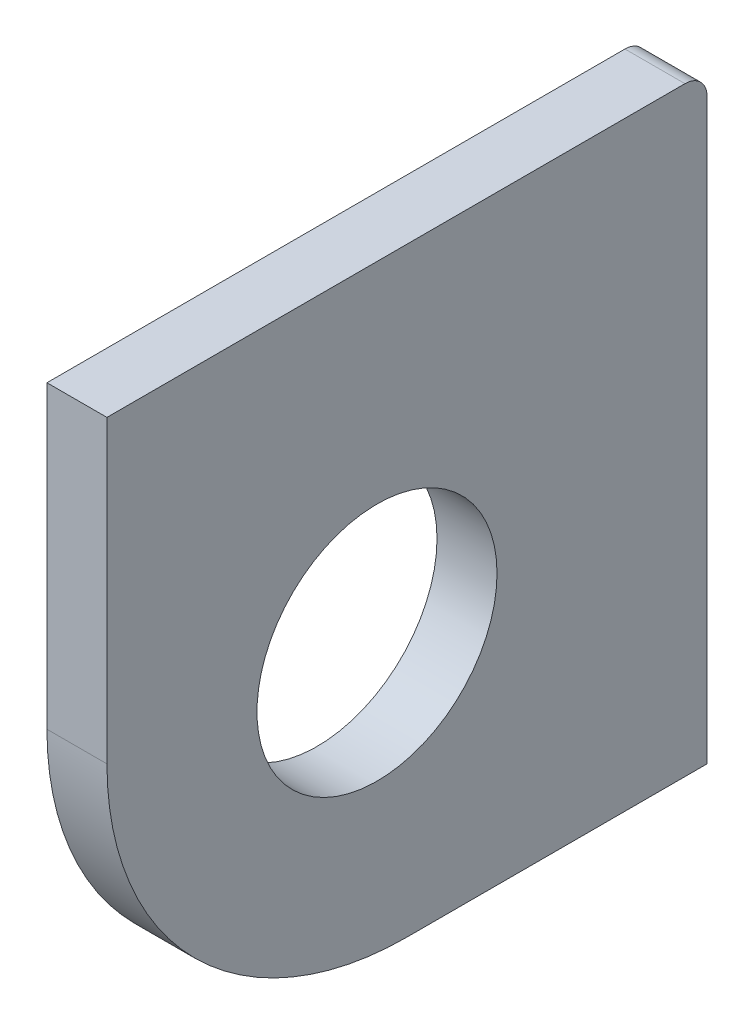
ISO-10303-21;
HEADER;
FILE_DESCRIPTION(('STEP AP214'),'2;1');
FILE_NAME('part.step','',(''),(''),'','','');
FILE_SCHEMA(('AUTOMOTIVE_DESIGN { 1 0 10303 214 1 1 1 1 }'));
ENDSEC;
DATA;
#1=APPLICATION_CONTEXT('core data for automotive mechanical design processes');
#2=APPLICATION_PROTOCOL_DEFINITION('international standard','automotive_design',2000,#1);
#3=PRODUCT_CONTEXT('',#1,'mechanical');
#4=PRODUCT('Part','Part','',(#3));
#5=PRODUCT_RELATED_PRODUCT_CATEGORY('part','',(#4));
#6=PRODUCT_DEFINITION_FORMATION('','',#4);
#7=PRODUCT_DEFINITION_CONTEXT('part definition',#1,'design');
#8=PRODUCT_DEFINITION('design','',#6,#7);
#9=PRODUCT_DEFINITION_SHAPE('','',#8);
#10=(LENGTH_UNIT() NAMED_UNIT(*) SI_UNIT(.MILLI.,.METRE.));
#11=(NAMED_UNIT(*) PLANE_ANGLE_UNIT() SI_UNIT($,.RADIAN.));
#12=(NAMED_UNIT(*) SI_UNIT($,.STERADIAN.) SOLID_ANGLE_UNIT());
#13=UNCERTAINTY_MEASURE_WITH_UNIT(LENGTH_MEASURE(1.E-05),#10,'distance_accuracy_value','');
#14=(GEOMETRIC_REPRESENTATION_CONTEXT(3) GLOBAL_UNCERTAINTY_ASSIGNED_CONTEXT((#13)) GLOBAL_UNIT_ASSIGNED_CONTEXT((#10,
#11,#12)) REPRESENTATION_CONTEXT('',''));
#15=CARTESIAN_POINT('',(0.,0.,0.));
#16=DIRECTION('',(0.,0.,1.));
#17=DIRECTION('',(1.,0.,0.));
#18=AXIS2_PLACEMENT_3D('',#15,#16,#17);
#19=CARTESIAN_POINT('',(140.,45.7366000000001,20.));
#20=DIRECTION('',(0.,-1.,0.));
#21=DIRECTION('',(0.,0.,-1.));
#22=AXIS2_PLACEMENT_3D('',#19,#20,#21);
#23=PLANE('',#22);
#24=DIRECTION('',(1.,0.,0.));
#25=VECTOR('',#24,1.);
#26=CARTESIAN_POINT('',(140.,45.7366000000001,10.));
#27=LINE('',#26,#25);
#28=CARTESIAN_POINT('',(138.,45.7366000000001,10.));
#29=VERTEX_POINT('',#28);
#30=CARTESIAN_POINT('',(140.,45.7366000000001,10.));
#31=VERTEX_POINT('',#30);
#32=EDGE_CURVE('E11',#29,#31,#27,.T.);
#33=ORIENTED_EDGE('',*,*,#32,.F.);
#34=DIRECTION('',(0.,0.,-1.));
#35=VECTOR('',#34,1.);
#36=CARTESIAN_POINT('',(138.,45.7366000000001,0.73660000000001));
#37=LINE('',#36,#35);
#38=CARTESIAN_POINT('',(138.,45.7366000000001,0.));
#39=VERTEX_POINT('',#38);
#40=EDGE_CURVE('E100',#29,#39,#37,.T.);
#41=ORIENTED_EDGE('',*,*,#40,.T.);
#42=DIRECTION('',(1.,0.,0.));
#43=VECTOR('',#42,1.);
#44=CARTESIAN_POINT('',(140.,45.7366000000001,0.));
#45=LINE('',#44,#43);
#46=CARTESIAN_POINT('',(140.,45.7366000000001,0.));
#47=VERTEX_POINT('',#46);
#48=EDGE_CURVE('E49',#39,#47,#45,.T.);
#49=ORIENTED_EDGE('',*,*,#48,.T.);
#50=DIRECTION('',(0.,0.,-1.));
#51=VECTOR('',#50,1.);
#52=CARTESIAN_POINT('',(140.,45.7366000000001,20.));
#53=LINE('',#52,#51);
#54=EDGE_CURVE('E129',#31,#47,#53,.T.);
#55=ORIENTED_EDGE('',*,*,#54,.F.);
#56=EDGE_LOOP('',(#33,#41,#49,#55));
#57=FACE_BOUND('',#56,.T.);
#58=ADVANCED_FACE('F39',(#57),#23,.T.);
#59=CARTESIAN_POINT('',(140.,45.7366000000001,0.));
#60=DIRECTION('',(0.,0.,-1.));
#61=DIRECTION('',(0.,1.,0.));
#62=AXIS2_PLACEMENT_3D('',#59,#60,#61);
#63=PLANE('',#62);
#64=ORIENTED_EDGE('',*,*,#48,.F.);
#65=DIRECTION('',(0.,1.,0.));
#66=VECTOR('',#65,1.);
#67=CARTESIAN_POINT('',(138.,65.,0.));
#68=LINE('',#67,#66);
#69=CARTESIAN_POINT('',(138.,65.,0.));
#70=VERTEX_POINT('',#69);
#71=EDGE_CURVE('E115',#39,#70,#68,.T.);
#72=ORIENTED_EDGE('',*,*,#71,.T.);
#73=DIRECTION('',(1.,0.,0.));
#74=VECTOR('',#73,1.);
#75=CARTESIAN_POINT('',(140.,65.,0.));
#76=LINE('',#75,#74);
#77=CARTESIAN_POINT('',(140.,65.,0.));
#78=VERTEX_POINT('',#77);
#79=EDGE_CURVE('E122',#70,#78,#76,.T.);
#80=ORIENTED_EDGE('',*,*,#79,.T.);
#81=DIRECTION('',(0.,1.,0.));
#82=VECTOR('',#81,1.);
#83=CARTESIAN_POINT('',(140.,45.7366000000001,0.));
#84=LINE('',#83,#82);
#85=EDGE_CURVE('E137',#47,#78,#84,.T.);
#86=ORIENTED_EDGE('',*,*,#85,.F.);
#87=EDGE_LOOP('',(#64,#72,#80,#86));
#88=FACE_BOUND('',#87,.T.);
#89=ADVANCED_FACE('F140',(#88),#63,.T.);
#90=CARTESIAN_POINT('',(140.,65.,0.73660000000001));
#91=DIRECTION('',(1.,0.,0.));
#92=DIRECTION('',(0.,0.,-1.));
#93=AXIS2_PLACEMENT_3D('',#90,#91,#92);
#94=CYLINDRICAL_SURFACE('',#93,0.736600000000007);
#95=ORIENTED_EDGE('',*,*,#79,.F.);
#96=CARTESIAN_POINT('',(138.,65.,0.73660000000001));
#97=DIRECTION('',(1.,0.,0.));
#98=DIRECTION('',(0.,0.,-1.));
#99=AXIS2_PLACEMENT_3D('',#96,#97,#98);
#100=CIRCLE('',#99,0.736600000000007);
#101=CARTESIAN_POINT('',(138.,65.7366,0.736600000000008));
#102=VERTEX_POINT('',#101);
#103=EDGE_CURVE('E112',#70,#102,#100,.T.);
#104=ORIENTED_EDGE('',*,*,#103,.T.);
#105=DIRECTION('',(1.,0.,0.));
#106=VECTOR('',#105,1.);
#107=CARTESIAN_POINT('',(140.,65.7366,0.736600000000008));
#108=LINE('',#107,#106);
#109=CARTESIAN_POINT('',(140.,65.7366,0.736600000000008));
#110=VERTEX_POINT('',#109);
#111=EDGE_CURVE('E120',#102,#110,#108,.T.);
#112=ORIENTED_EDGE('',*,*,#111,.T.);
#113=CARTESIAN_POINT('',(140.,65.,0.73660000000001));
#114=DIRECTION('',(1.,0.,0.));
#115=DIRECTION('',(0.,0.,-1.));
#116=AXIS2_PLACEMENT_3D('',#113,#114,#115);
#117=CIRCLE('',#116,0.736600000000007);
#118=EDGE_CURVE('E141',#78,#110,#117,.T.);
#119=ORIENTED_EDGE('',*,*,#118,.F.);
#120=EDGE_LOOP('',(#95,#104,#112,#119));
#121=FACE_BOUND('',#120,.T.);
#122=ADVANCED_FACE('F150',(#121),#94,.T.);
#123=CARTESIAN_POINT('',(140.,65.7366000000001,20.));
#124=DIRECTION('',(0.,1.,0.));
#125=DIRECTION('',(0.,0.,1.));
#126=AXIS2_PLACEMENT_3D('',#123,#124,#125);
#127=PLANE('',#126);
#128=ORIENTED_EDGE('',*,*,#111,.F.);
#129=DIRECTION('',(0.,0.,-1.));
#130=VECTOR('',#129,1.);
#131=CARTESIAN_POINT('',(138.,65.7366,0.73660000000001));
#132=LINE('',#131,#130);
#133=CARTESIAN_POINT('',(138.,65.7366000000001,20.));
#134=VERTEX_POINT('',#133);
#135=EDGE_CURVE('E109',#102,#134,#132,.F.);
#136=ORIENTED_EDGE('',*,*,#135,.T.);
#137=DIRECTION('',(1.,0.,0.));
#138=VECTOR('',#137,1.);
#139=CARTESIAN_POINT('',(140.,65.7366000000001,20.));
#140=LINE('',#139,#138);
#141=CARTESIAN_POINT('',(140.,65.7366000000001,20.));
#142=VERTEX_POINT('',#141);
#143=EDGE_CURVE('E57',#134,#142,#140,.T.);
#144=ORIENTED_EDGE('',*,*,#143,.T.);
#145=DIRECTION('',(0.,0.,1.));
#146=VECTOR('',#145,1.);
#147=CARTESIAN_POINT('',(140.,65.7366000000001,20.));
#148=LINE('',#147,#146);
#149=EDGE_CURVE('E93',#110,#142,#148,.T.);
#150=ORIENTED_EDGE('',*,*,#149,.F.);
#151=EDGE_LOOP('',(#128,#136,#144,#150));
#152=FACE_BOUND('',#151,.T.);
#153=ADVANCED_FACE('F147',(#152),#127,.T.);
#154=CARTESIAN_POINT('',(140.,65.7366000000001,20.));
#155=DIRECTION('',(0.,0.,1.));
#156=DIRECTION('',(0.,-1.,0.));
#157=AXIS2_PLACEMENT_3D('',#154,#155,#156);
#158=PLANE('',#157);
#159=ORIENTED_EDGE('',*,*,#143,.F.);
#160=DIRECTION('',(0.,1.,0.));
#161=VECTOR('',#160,1.);
#162=CARTESIAN_POINT('',(138.,65.,20.));
#163=LINE('',#162,#161);
#164=CARTESIAN_POINT('',(138.,55.7366000000001,20.));
#165=VERTEX_POINT('',#164);
#166=EDGE_CURVE('E98',#134,#165,#163,.F.);
#167=ORIENTED_EDGE('',*,*,#166,.T.);
#168=DIRECTION('',(1.,0.,0.));
#169=VECTOR('',#168,1.);
#170=CARTESIAN_POINT('',(140.,55.7366000000001,20.));
#171=LINE('',#170,#169);
#172=CARTESIAN_POINT('',(140.,55.7366000000001,20.));
#173=VERTEX_POINT('',#172);
#174=EDGE_CURVE('E43',#165,#173,#171,.T.);
#175=ORIENTED_EDGE('',*,*,#174,.T.);
#176=DIRECTION('',(0.,-1.,0.));
#177=VECTOR('',#176,1.);
#178=CARTESIAN_POINT('',(140.,65.7366000000001,20.));
#179=LINE('',#178,#177);
#180=EDGE_CURVE('E146',#142,#173,#179,.T.);
#181=ORIENTED_EDGE('',*,*,#180,.F.);
#182=EDGE_LOOP('',(#159,#167,#175,#181));
#183=FACE_BOUND('',#182,.T.);
#184=ADVANCED_FACE('F102',(#183),#158,.T.);
#185=CARTESIAN_POINT('',(140.,54.7366000000001,11.));
#186=DIRECTION('',(1.,0.,0.));
#187=DIRECTION('',(0.,0.,-1.));
#188=AXIS2_PLACEMENT_3D('',#185,#186,#187);
#189=CYLINDRICAL_SURFACE('',#188,3.99999999999996);
#190=CARTESIAN_POINT('',(140.,54.7366000000001,11.));
#191=DIRECTION('',(1.,0.,0.));
#192=DIRECTION('',(0.,0.,-1.));
#193=AXIS2_PLACEMENT_3D('',#190,#191,#192);
#194=CIRCLE('',#193,3.99999999999996);
#195=CARTESIAN_POINT('',(140.,54.7366000000001,7.00000000000004));
#196=VERTEX_POINT('',#195);
#197=EDGE_CURVE('E111',#196,#196,#194,.T.);
#198=ORIENTED_EDGE('',*,*,#197,.T.);
#199=EDGE_LOOP('',(#198));
#200=FACE_BOUND('',#199,.T.);
#201=CARTESIAN_POINT('',(138.,54.7366000000001,11.));
#202=DIRECTION('',(1.,0.,0.));
#203=DIRECTION('',(0.,0.,-1.));
#204=AXIS2_PLACEMENT_3D('',#201,#202,#203);
#205=CIRCLE('',#204,3.99999999999996);
#206=CARTESIAN_POINT('',(138.,54.7366000000001,7.00000000000004));
#207=VERTEX_POINT('',#206);
#208=EDGE_CURVE('E103',#207,#207,#205,.T.);
#209=ORIENTED_EDGE('',*,*,#208,.F.);
#210=EDGE_LOOP('',(#209));
#211=FACE_BOUND('',#210,.T.);
#212=ADVANCED_FACE('F191',(#200,#211),#189,.F.);
#213=CARTESIAN_POINT('',(140.,55.7366000000001,10.));
#214=DIRECTION('',(1.,0.,0.));
#215=DIRECTION('',(0.,0.,-1.));
#216=AXIS2_PLACEMENT_3D('',#213,#214,#215);
#217=CYLINDRICAL_SURFACE('',#216,10.);
#218=CARTESIAN_POINT('',(138.,55.7366000000001,10.));
#219=DIRECTION('',(1.,0.,0.));
#220=DIRECTION('',(0.,0.,-1.));
#221=AXIS2_PLACEMENT_3D('',#218,#219,#220);
#222=CIRCLE('',#221,10.);
#223=EDGE_CURVE('E87',#165,#29,#222,.T.);
#224=ORIENTED_EDGE('',*,*,#223,.T.);
#225=ORIENTED_EDGE('',*,*,#32,.T.);
#226=CARTESIAN_POINT('',(140.,55.7366000000001,10.));
#227=DIRECTION('',(1.,0.,0.));
#228=DIRECTION('',(0.,0.,-1.));
#229=AXIS2_PLACEMENT_3D('',#226,#227,#228);
#230=CIRCLE('',#229,10.);
#231=EDGE_CURVE('E89',#173,#31,#230,.T.);
#232=ORIENTED_EDGE('',*,*,#231,.F.);
#233=ORIENTED_EDGE('',*,*,#174,.F.);
#234=EDGE_LOOP('',(#224,#225,#232,#233));
#235=FACE_BOUND('',#234,.T.);
#236=ADVANCED_FACE('F41',(#235),#217,.T.);
#237=CARTESIAN_POINT('',(140.,65.,0.73660000000001));
#238=DIRECTION('',(1.,0.,0.));
#239=DIRECTION('',(0.,0.,-1.));
#240=AXIS2_PLACEMENT_3D('',#237,#238,#239);
#241=PLANE('',#240);
#242=ORIENTED_EDGE('',*,*,#197,.F.);
#243=EDGE_LOOP('',(#242));
#244=FACE_BOUND('',#243,.T.);
#245=ORIENTED_EDGE('',*,*,#180,.T.);
#246=ORIENTED_EDGE('',*,*,#231,.T.);
#247=ORIENTED_EDGE('',*,*,#54,.T.);
#248=ORIENTED_EDGE('',*,*,#85,.T.);
#249=ORIENTED_EDGE('',*,*,#118,.T.);
#250=ORIENTED_EDGE('',*,*,#149,.T.);
#251=EDGE_LOOP('',(#245,#246,#247,#248,#249,#250));
#252=FACE_BOUND('',#251,.T.);
#253=ADVANCED_FACE('F135',(#244,#252),#241,.T.);
#254=CARTESIAN_POINT('',(138.,65.,0.73660000000001));
#255=DIRECTION('',(1.,0.,0.));
#256=DIRECTION('',(0.,0.,-1.));
#257=AXIS2_PLACEMENT_3D('',#254,#255,#256);
#258=PLANE('',#257);
#259=ORIENTED_EDGE('',*,*,#208,.T.);
#260=EDGE_LOOP('',(#259));
#261=FACE_BOUND('',#260,.T.);
#262=ORIENTED_EDGE('',*,*,#166,.F.);
#263=ORIENTED_EDGE('',*,*,#135,.F.);
#264=ORIENTED_EDGE('',*,*,#103,.F.);
#265=ORIENTED_EDGE('',*,*,#71,.F.);
#266=ORIENTED_EDGE('',*,*,#40,.F.);
#267=ORIENTED_EDGE('',*,*,#223,.F.);
#268=EDGE_LOOP('',(#262,#263,#264,#265,#266,#267));
#269=FACE_BOUND('',#268,.T.);
#270=ADVANCED_FACE('F96',(#261,#269),#258,.F.);
#271=CLOSED_SHELL('',(#58,#89,#122,#153,#184,#212,#236,#253,#270));
#272=MANIFOLD_SOLID_BREP('B2',#271);
#273=ADVANCED_BREP_SHAPE_REPRESENTATION('',(#18,#272),#14);
#274=SHAPE_DEFINITION_REPRESENTATION(#9,#273);
ENDSEC;
END-ISO-10303-21;
